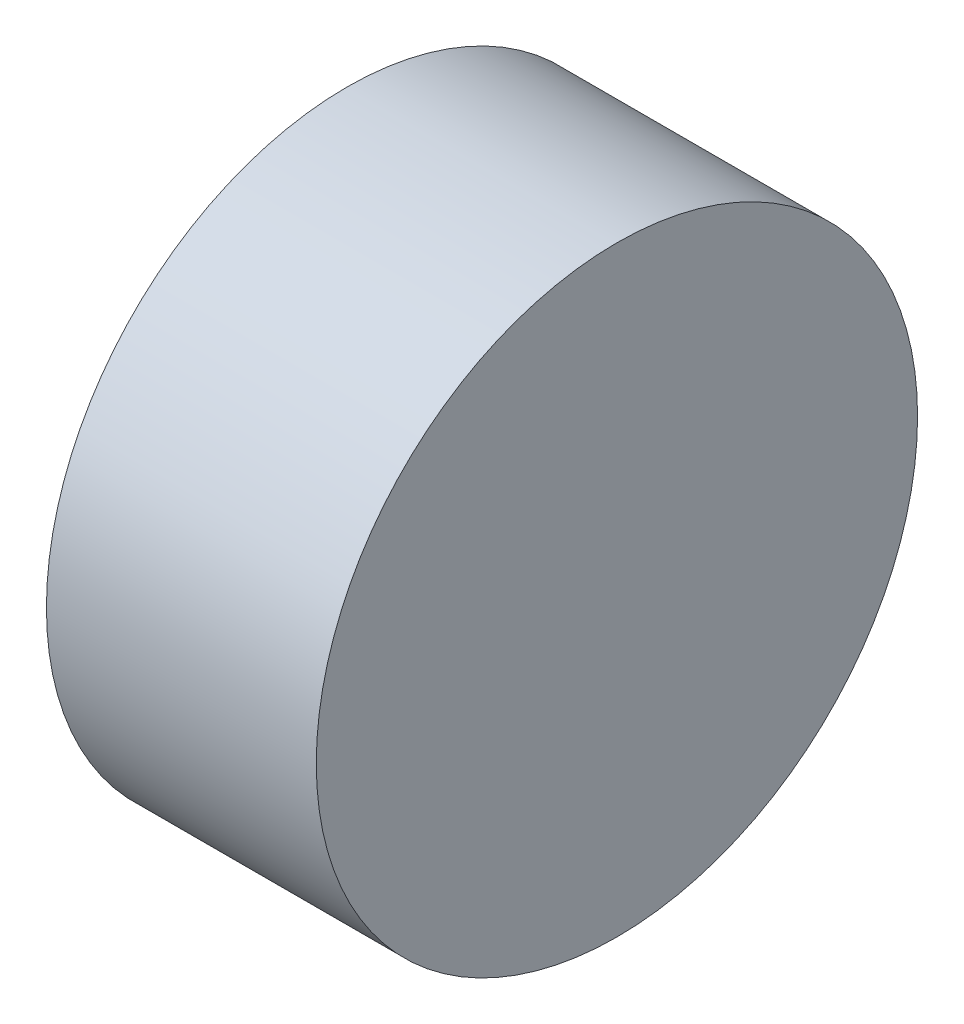
ISO-10303-21;
HEADER;
FILE_DESCRIPTION(('STEP AP214'),'2;1');
FILE_NAME('part.step','',(''),(''),'','','');
FILE_SCHEMA(('AUTOMOTIVE_DESIGN { 1 0 10303 214 1 1 1 1 }'));
ENDSEC;
DATA;
#1=APPLICATION_CONTEXT('core data for automotive mechanical design processes');
#2=APPLICATION_PROTOCOL_DEFINITION('international standard','automotive_design',2000,#1);
#3=PRODUCT_CONTEXT('',#1,'mechanical');
#4=PRODUCT('Part','Part','',(#3));
#5=PRODUCT_RELATED_PRODUCT_CATEGORY('part','',(#4));
#6=PRODUCT_DEFINITION_FORMATION('','',#4);
#7=PRODUCT_DEFINITION_CONTEXT('part definition',#1,'design');
#8=PRODUCT_DEFINITION('design','',#6,#7);
#9=PRODUCT_DEFINITION_SHAPE('','',#8);
#10=(LENGTH_UNIT() NAMED_UNIT(*) SI_UNIT(.MILLI.,.METRE.));
#11=(NAMED_UNIT(*) PLANE_ANGLE_UNIT() SI_UNIT($,.RADIAN.));
#12=(NAMED_UNIT(*) SI_UNIT($,.STERADIAN.) SOLID_ANGLE_UNIT());
#13=UNCERTAINTY_MEASURE_WITH_UNIT(LENGTH_MEASURE(1.E-05),#10,'distance_accuracy_value','');
#14=(GEOMETRIC_REPRESENTATION_CONTEXT(3) GLOBAL_UNCERTAINTY_ASSIGNED_CONTEXT((#13)) GLOBAL_UNIT_ASSIGNED_CONTEXT((#10,
#11,#12)) REPRESENTATION_CONTEXT('',''));
#15=CARTESIAN_POINT('',(0.,0.,0.));
#16=DIRECTION('',(0.,0.,1.));
#17=DIRECTION('',(1.,0.,0.));
#18=AXIS2_PLACEMENT_3D('',#15,#16,#17);
#19=CARTESIAN_POINT('',(20.,0.,0.));
#20=DIRECTION('',(-1.,0.,0.));
#21=DIRECTION('',(0.,0.,1.));
#22=AXIS2_PLACEMENT_3D('',#19,#20,#21);
#23=CYLINDRICAL_SURFACE('',#22,22.2826345977797);
#24=CARTESIAN_POINT('',(20.,0.,0.));
#25=DIRECTION('',(1.,0.,0.));
#26=DIRECTION('',(0.,0.,-1.));
#27=AXIS2_PLACEMENT_3D('',#24,#25,#26);
#28=CIRCLE('',#27,22.2826345977797);
#29=CARTESIAN_POINT('',(20.,0.,-22.2826345977797));
#30=VERTEX_POINT('',#29);
#31=EDGE_CURVE('E10',#30,#30,#28,.T.);
#32=ORIENTED_EDGE('',*,*,#31,.F.);
#33=EDGE_LOOP('',(#32));
#34=FACE_BOUND('',#33,.T.);
#35=CARTESIAN_POINT('',(0.,0.,0.));
#36=DIRECTION('',(1.,0.,0.));
#37=DIRECTION('',(0.,0.,-1.));
#38=AXIS2_PLACEMENT_3D('',#35,#36,#37);
#39=CIRCLE('',#38,22.2826345977797);
#40=CARTESIAN_POINT('',(0.,0.,-22.2826345977797));
#41=VERTEX_POINT('',#40);
#42=EDGE_CURVE('E40',#41,#41,#39,.T.);
#43=ORIENTED_EDGE('',*,*,#42,.T.);
#44=EDGE_LOOP('',(#43));
#45=FACE_BOUND('',#44,.T.);
#46=ADVANCED_FACE('F37',(#34,#45),#23,.T.);
#47=CARTESIAN_POINT('',(20.,0.,0.));
#48=DIRECTION('',(1.,0.,0.));
#49=DIRECTION('',(0.,0.,-1.));
#50=AXIS2_PLACEMENT_3D('',#47,#48,#49);
#51=PLANE('',#50);
#52=ORIENTED_EDGE('',*,*,#31,.T.);
#53=EDGE_LOOP('',(#52));
#54=FACE_BOUND('',#53,.T.);
#55=ADVANCED_FACE('F54',(#54),#51,.T.);
#56=CARTESIAN_POINT('',(0.,0.,0.));
#57=DIRECTION('',(1.,0.,0.));
#58=DIRECTION('',(0.,0.,-1.));
#59=AXIS2_PLACEMENT_3D('',#56,#57,#58);
#60=PLANE('',#59);
#61=ORIENTED_EDGE('',*,*,#42,.F.);
#62=EDGE_LOOP('',(#61));
#63=FACE_BOUND('',#62,.T.);
#64=ADVANCED_FACE('F52',(#63),#60,.F.);
#65=CLOSED_SHELL('',(#46,#55,#64));
#66=MANIFOLD_SOLID_BREP('B2',#65);
#67=ADVANCED_BREP_SHAPE_REPRESENTATION('',(#18,#66),#14);
#68=SHAPE_DEFINITION_REPRESENTATION(#9,#67);
ENDSEC;
END-ISO-10303-21;
